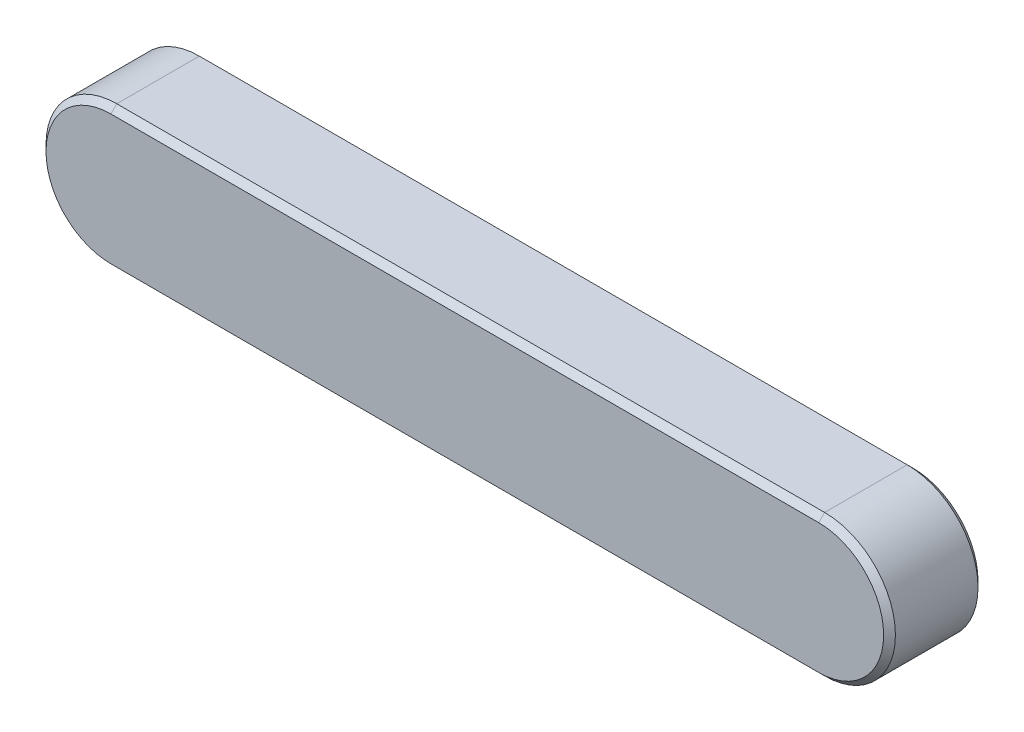
ISO-10303-21;
HEADER;
FILE_DESCRIPTION(('STEP AP214'),'2;1');
FILE_NAME('part.step','',(''),(''),'','','');
FILE_SCHEMA(('AUTOMOTIVE_DESIGN { 1 0 10303 214 1 1 1 1 }'));
ENDSEC;
DATA;
#1=APPLICATION_CONTEXT('core data for automotive mechanical design processes');
#2=APPLICATION_PROTOCOL_DEFINITION('international standard','automotive_design',2000,#1);
#3=PRODUCT_CONTEXT('',#1,'mechanical');
#4=PRODUCT('Part','Part','',(#3));
#5=PRODUCT_RELATED_PRODUCT_CATEGORY('part','',(#4));
#6=PRODUCT_DEFINITION_FORMATION('','',#4);
#7=PRODUCT_DEFINITION_CONTEXT('part definition',#1,'design');
#8=PRODUCT_DEFINITION('design','',#6,#7);
#9=PRODUCT_DEFINITION_SHAPE('','',#8);
#10=(LENGTH_UNIT() NAMED_UNIT(*) SI_UNIT(.MILLI.,.METRE.));
#11=(NAMED_UNIT(*) PLANE_ANGLE_UNIT() SI_UNIT($,.RADIAN.));
#12=(NAMED_UNIT(*) SI_UNIT($,.STERADIAN.) SOLID_ANGLE_UNIT());
#13=UNCERTAINTY_MEASURE_WITH_UNIT(LENGTH_MEASURE(1.E-05),#10,'distance_accuracy_value','');
#14=(GEOMETRIC_REPRESENTATION_CONTEXT(3) GLOBAL_UNCERTAINTY_ASSIGNED_CONTEXT((#13)) GLOBAL_UNIT_ASSIGNED_CONTEXT((#10,
#11,#12)) REPRESENTATION_CONTEXT('',''));
#15=CARTESIAN_POINT('',(0.,0.,0.));
#16=DIRECTION('',(0.,0.,1.));
#17=DIRECTION('',(1.,0.,0.));
#18=AXIS2_PLACEMENT_3D('',#15,#16,#17);
#19=CARTESIAN_POINT('',(0.,0.,4.));
#20=DIRECTION('',(0.,0.,-1.));
#21=DIRECTION('',(-1.,0.,0.));
#22=AXIS2_PLACEMENT_3D('',#19,#20,#21);
#23=CYLINDRICAL_SURFACE('',#22,3.);
#24=DIRECTION('',(0.,0.,-1.));
#25=VECTOR('',#24,1.);
#26=CARTESIAN_POINT('',(0.,-3.,4.));
#27=LINE('',#26,#25);
#28=CARTESIAN_POINT('',(0.,-3.,3.75));
#29=VERTEX_POINT('',#28);
#30=CARTESIAN_POINT('',(0.,-3.,0.249999999999997));
#31=VERTEX_POINT('',#30);
#32=EDGE_CURVE('E152',#29,#31,#27,.T.);
#33=ORIENTED_EDGE('',*,*,#32,.T.);
#34=CARTESIAN_POINT('',(0.,0.,0.249999999999997));
#35=DIRECTION('',(0.,0.,1.));
#36=DIRECTION('',(1.,0.,0.));
#37=AXIS2_PLACEMENT_3D('',#34,#35,#36);
#38=CIRCLE('',#37,3.);
#39=CARTESIAN_POINT('',(0.,3.,0.249999999999997));
#40=VERTEX_POINT('',#39);
#41=EDGE_CURVE('E176',#31,#40,#38,.T.);
#42=ORIENTED_EDGE('',*,*,#41,.T.);
#43=DIRECTION('',(0.,0.,-1.));
#44=VECTOR('',#43,1.);
#45=CARTESIAN_POINT('',(0.,3.,4.));
#46=LINE('',#45,#44);
#47=CARTESIAN_POINT('',(0.,3.,3.75));
#48=VERTEX_POINT('',#47);
#49=EDGE_CURVE('E121',#48,#40,#46,.T.);
#50=ORIENTED_EDGE('',*,*,#49,.F.);
#51=CARTESIAN_POINT('',(0.,0.,3.75));
#52=DIRECTION('',(0.,0.,1.));
#53=DIRECTION('',(1.,0.,0.));
#54=AXIS2_PLACEMENT_3D('',#51,#52,#53);
#55=CIRCLE('',#54,3.);
#56=EDGE_CURVE('E174',#48,#29,#55,.F.);
#57=ORIENTED_EDGE('',*,*,#56,.T.);
#58=EDGE_LOOP('',(#33,#42,#50,#57));
#59=FACE_BOUND('',#58,.T.);
#60=ADVANCED_FACE('F30',(#59),#23,.T.);
#61=CARTESIAN_POINT('',(0.,3.,4.));
#62=DIRECTION('',(0.,-1.,0.));
#63=DIRECTION('',(1.,0.,0.));
#64=AXIS2_PLACEMENT_3D('',#61,#62,#63);
#65=PLANE('',#64);
#66=ORIENTED_EDGE('',*,*,#49,.T.);
#67=DIRECTION('',(-1.,0.,0.));
#68=VECTOR('',#67,1.);
#69=CARTESIAN_POINT('',(0.,3.,0.249999999999993));
#70=LINE('',#69,#68);
#71=CARTESIAN_POINT('',(-30.,3.,0.249999999999997));
#72=VERTEX_POINT('',#71);
#73=EDGE_CURVE('E120',#40,#72,#70,.T.);
#74=ORIENTED_EDGE('',*,*,#73,.T.);
#75=DIRECTION('',(0.,0.,-1.));
#76=VECTOR('',#75,1.);
#77=CARTESIAN_POINT('',(-30.,3.,4.));
#78=LINE('',#77,#76);
#79=CARTESIAN_POINT('',(-30.,3.,3.75));
#80=VERTEX_POINT('',#79);
#81=EDGE_CURVE('E103',#80,#72,#78,.T.);
#82=ORIENTED_EDGE('',*,*,#81,.F.);
#83=DIRECTION('',(1.,0.,0.));
#84=VECTOR('',#83,1.);
#85=CARTESIAN_POINT('',(0.,3.,3.75));
#86=LINE('',#85,#84);
#87=EDGE_CURVE('E117',#80,#48,#86,.T.);
#88=ORIENTED_EDGE('',*,*,#87,.T.);
#89=EDGE_LOOP('',(#66,#74,#82,#88));
#90=FACE_BOUND('',#89,.T.);
#91=ADVANCED_FACE('F116',(#90),#65,.F.);
#92=CARTESIAN_POINT('',(-30.,0.,4.));
#93=DIRECTION('',(0.,0.,-1.));
#94=DIRECTION('',(-1.,0.,0.));
#95=AXIS2_PLACEMENT_3D('',#92,#93,#94);
#96=CYLINDRICAL_SURFACE('',#95,3.);
#97=ORIENTED_EDGE('',*,*,#81,.T.);
#98=CARTESIAN_POINT('',(-30.,0.,0.249999999999997));
#99=DIRECTION('',(0.,0.,1.));
#100=DIRECTION('',(1.,0.,0.));
#101=AXIS2_PLACEMENT_3D('',#98,#99,#100);
#102=CIRCLE('',#101,3.);
#103=CARTESIAN_POINT('',(-30.,-3.,0.249999999999997));
#104=VERTEX_POINT('',#103);
#105=EDGE_CURVE('E109',#72,#104,#102,.T.);
#106=ORIENTED_EDGE('',*,*,#105,.T.);
#107=DIRECTION('',(0.,0.,-1.));
#108=VECTOR('',#107,1.);
#109=CARTESIAN_POINT('',(-30.,-3.,4.));
#110=LINE('',#109,#108);
#111=CARTESIAN_POINT('',(-30.,-3.,3.75));
#112=VERTEX_POINT('',#111);
#113=EDGE_CURVE('E105',#112,#104,#110,.T.);
#114=ORIENTED_EDGE('',*,*,#113,.F.);
#115=CARTESIAN_POINT('',(-30.,0.,3.75));
#116=DIRECTION('',(0.,0.,1.));
#117=DIRECTION('',(1.,0.,0.));
#118=AXIS2_PLACEMENT_3D('',#115,#116,#117);
#119=CIRCLE('',#118,3.);
#120=EDGE_CURVE('E100',#112,#80,#119,.F.);
#121=ORIENTED_EDGE('',*,*,#120,.T.);
#122=EDGE_LOOP('',(#97,#106,#114,#121));
#123=FACE_BOUND('',#122,.T.);
#124=ADVANCED_FACE('F102',(#123),#96,.T.);
#125=CARTESIAN_POINT('',(-30.,-3.,4.));
#126=DIRECTION('',(0.,1.,0.));
#127=DIRECTION('',(0.,0.,1.));
#128=AXIS2_PLACEMENT_3D('',#125,#126,#127);
#129=PLANE('',#128);
#130=ORIENTED_EDGE('',*,*,#113,.T.);
#131=DIRECTION('',(1.,0.,0.));
#132=VECTOR('',#131,1.);
#133=CARTESIAN_POINT('',(-30.,-3.,0.249999999999997));
#134=LINE('',#133,#132);
#135=EDGE_CURVE('E180',#104,#31,#134,.T.);
#136=ORIENTED_EDGE('',*,*,#135,.T.);
#137=ORIENTED_EDGE('',*,*,#32,.F.);
#138=DIRECTION('',(-1.,0.,0.));
#139=VECTOR('',#138,1.);
#140=CARTESIAN_POINT('',(-30.,-3.,3.75));
#141=LINE('',#140,#139);
#142=EDGE_CURVE('E178',#29,#112,#141,.T.);
#143=ORIENTED_EDGE('',*,*,#142,.T.);
#144=EDGE_LOOP('',(#130,#136,#137,#143));
#145=FACE_BOUND('',#144,.T.);
#146=ADVANCED_FACE('F190',(#145),#129,.F.);
#147=CARTESIAN_POINT('',(0.,0.,4.));
#148=DIRECTION('',(0.,0.,1.));
#149=DIRECTION('',(1.,0.,0.));
#150=AXIS2_PLACEMENT_3D('',#147,#148,#149);
#151=PLANE('',#150);
#152=CARTESIAN_POINT('',(0.,0.,4.));
#153=DIRECTION('',(0.,0.,1.));
#154=DIRECTION('',(1.,0.,0.));
#155=AXIS2_PLACEMENT_3D('',#152,#153,#154);
#156=CIRCLE('',#155,2.75);
#157=CARTESIAN_POINT('',(0.,-2.75,4.));
#158=VERTEX_POINT('',#157);
#159=CARTESIAN_POINT('',(0.,2.75,4.));
#160=VERTEX_POINT('',#159);
#161=EDGE_CURVE('E54',#158,#160,#156,.T.);
#162=ORIENTED_EDGE('',*,*,#161,.T.);
#163=DIRECTION('',(-1.,0.,0.));
#164=VECTOR('',#163,1.);
#165=CARTESIAN_POINT('',(-30.,2.75,4.));
#166=LINE('',#165,#164);
#167=CARTESIAN_POINT('',(-30.,2.75,4.));
#168=VERTEX_POINT('',#167);
#169=EDGE_CURVE('E11',#160,#168,#166,.T.);
#170=ORIENTED_EDGE('',*,*,#169,.T.);
#171=CARTESIAN_POINT('',(-30.,0.,4.));
#172=DIRECTION('',(0.,0.,1.));
#173=DIRECTION('',(1.,0.,0.));
#174=AXIS2_PLACEMENT_3D('',#171,#172,#173);
#175=CIRCLE('',#174,2.75);
#176=CARTESIAN_POINT('',(-30.,-2.75,4.));
#177=VERTEX_POINT('',#176);
#178=EDGE_CURVE('E39',#168,#177,#175,.T.);
#179=ORIENTED_EDGE('',*,*,#178,.T.);
#180=DIRECTION('',(1.,0.,0.));
#181=VECTOR('',#180,1.);
#182=CARTESIAN_POINT('',(0.,-2.75,4.));
#183=LINE('',#182,#181);
#184=EDGE_CURVE('E182',#177,#158,#183,.T.);
#185=ORIENTED_EDGE('',*,*,#184,.T.);
#186=EDGE_LOOP('',(#162,#170,#179,#185));
#187=FACE_BOUND('',#186,.T.);
#188=ADVANCED_FACE('F185',(#187),#151,.T.);
#189=CARTESIAN_POINT('',(0.,0.,0.));
#190=DIRECTION('',(0.,0.,1.));
#191=DIRECTION('',(1.,0.,0.));
#192=AXIS2_PLACEMENT_3D('',#189,#190,#191);
#193=PLANE('',#192);
#194=CARTESIAN_POINT('',(-30.,0.,0.));
#195=DIRECTION('',(0.,0.,1.));
#196=DIRECTION('',(1.,0.,0.));
#197=AXIS2_PLACEMENT_3D('',#194,#195,#196);
#198=CIRCLE('',#197,2.75);
#199=CARTESIAN_POINT('',(-30.,-2.75,0.));
#200=VERTEX_POINT('',#199);
#201=CARTESIAN_POINT('',(-30.,2.75,0.));
#202=VERTEX_POINT('',#201);
#203=EDGE_CURVE('E169',#200,#202,#198,.F.);
#204=ORIENTED_EDGE('',*,*,#203,.T.);
#205=DIRECTION('',(1.,0.,0.));
#206=VECTOR('',#205,1.);
#207=CARTESIAN_POINT('',(0.,2.75,0.));
#208=LINE('',#207,#206);
#209=CARTESIAN_POINT('',(0.,2.75,0.));
#210=VERTEX_POINT('',#209);
#211=EDGE_CURVE('E110',#202,#210,#208,.T.);
#212=ORIENTED_EDGE('',*,*,#211,.T.);
#213=CARTESIAN_POINT('',(0.,0.,0.));
#214=DIRECTION('',(0.,0.,1.));
#215=DIRECTION('',(1.,0.,0.));
#216=AXIS2_PLACEMENT_3D('',#213,#214,#215);
#217=CIRCLE('',#216,2.75);
#218=CARTESIAN_POINT('',(0.,-2.75,0.));
#219=VERTEX_POINT('',#218);
#220=EDGE_CURVE('E167',#210,#219,#217,.F.);
#221=ORIENTED_EDGE('',*,*,#220,.T.);
#222=DIRECTION('',(-1.,0.,0.));
#223=VECTOR('',#222,1.);
#224=CARTESIAN_POINT('',(0.,-2.75,0.));
#225=LINE('',#224,#223);
#226=EDGE_CURVE('E165',#219,#200,#225,.T.);
#227=ORIENTED_EDGE('',*,*,#226,.T.);
#228=EDGE_LOOP('',(#204,#212,#221,#227));
#229=FACE_BOUND('',#228,.T.);
#230=ADVANCED_FACE('F217',(#229),#193,.F.);
#231=CARTESIAN_POINT('',(-30.,-3.,0.249999999999997));
#232=DIRECTION('',(0.,0.707106781186543,0.707106781186552));
#233=DIRECTION('',(0.,-0.707106781186552,0.707106781186543));
#234=AXIS2_PLACEMENT_3D('',#231,#232,#233);
#235=PLANE('',#234);
#236=DIRECTION('',(0.,-0.707106781186552,0.707106781186543));
#237=VECTOR('',#236,1.);
#238=CARTESIAN_POINT('',(-30.,-2.75,0.));
#239=LINE('',#238,#237);
#240=EDGE_CURVE('E144',#200,#104,#239,.T.);
#241=ORIENTED_EDGE('',*,*,#240,.F.);
#242=ORIENTED_EDGE('',*,*,#226,.F.);
#243=DIRECTION('',(0.,0.707106781186552,-0.707106781186543));
#244=VECTOR('',#243,1.);
#245=CARTESIAN_POINT('',(0.,-3.,0.249999999999997));
#246=LINE('',#245,#244);
#247=EDGE_CURVE('E132',#31,#219,#246,.T.);
#248=ORIENTED_EDGE('',*,*,#247,.F.);
#249=ORIENTED_EDGE('',*,*,#135,.F.);
#250=EDGE_LOOP('',(#241,#242,#248,#249));
#251=FACE_BOUND('',#250,.T.);
#252=ADVANCED_FACE('F193',(#251),#235,.F.);
#253=CARTESIAN_POINT('',(0.,0.,0.249999999999997));
#254=DIRECTION('',(0.,0.,1.));
#255=DIRECTION('',(1.,0.,0.));
#256=AXIS2_PLACEMENT_3D('',#253,#254,#255);
#257=CONICAL_SURFACE('',#256,3.,0.785398163397455);
#258=ORIENTED_EDGE('',*,*,#247,.T.);
#259=ORIENTED_EDGE('',*,*,#220,.F.);
#260=DIRECTION('',(0.,-0.707106781186552,-0.707106781186543));
#261=VECTOR('',#260,1.);
#262=CARTESIAN_POINT('',(0.,3.,0.249999999999997));
#263=LINE('',#262,#261);
#264=EDGE_CURVE('E138',#40,#210,#263,.T.);
#265=ORIENTED_EDGE('',*,*,#264,.F.);
#266=ORIENTED_EDGE('',*,*,#41,.F.);
#267=EDGE_LOOP('',(#258,#259,#265,#266));
#268=FACE_BOUND('',#267,.T.);
#269=ADVANCED_FACE('F196',(#268),#257,.T.);
#270=CARTESIAN_POINT('',(-30.,0.,0.249999999999997));
#271=DIRECTION('',(0.,0.,1.));
#272=DIRECTION('',(1.,0.,0.));
#273=AXIS2_PLACEMENT_3D('',#270,#271,#272);
#274=CONICAL_SURFACE('',#273,3.,0.785398163397455);
#275=ORIENTED_EDGE('',*,*,#240,.T.);
#276=ORIENTED_EDGE('',*,*,#105,.F.);
#277=DIRECTION('',(0.,0.707106781186552,0.707106781186543));
#278=VECTOR('',#277,1.);
#279=CARTESIAN_POINT('',(-30.,2.75,0.));
#280=LINE('',#279,#278);
#281=EDGE_CURVE('E135',#202,#72,#280,.T.);
#282=ORIENTED_EDGE('',*,*,#281,.F.);
#283=ORIENTED_EDGE('',*,*,#203,.F.);
#284=EDGE_LOOP('',(#275,#276,#282,#283));
#285=FACE_BOUND('',#284,.T.);
#286=ADVANCED_FACE('F199',(#285),#274,.T.);
#287=CARTESIAN_POINT('',(0.,3.,0.249999999999993));
#288=DIRECTION('',(0.,-0.707106781186543,0.707106781186552));
#289=DIRECTION('',(0.,-0.707106781186552,-0.707106781186543));
#290=AXIS2_PLACEMENT_3D('',#287,#288,#289);
#291=PLANE('',#290);
#292=ORIENTED_EDGE('',*,*,#264,.T.);
#293=ORIENTED_EDGE('',*,*,#211,.F.);
#294=ORIENTED_EDGE('',*,*,#281,.T.);
#295=ORIENTED_EDGE('',*,*,#73,.F.);
#296=EDGE_LOOP('',(#292,#293,#294,#295));
#297=FACE_BOUND('',#296,.T.);
#298=ADVANCED_FACE('F197',(#297),#291,.F.);
#299=CARTESIAN_POINT('',(0.,-2.75,4.));
#300=DIRECTION('',(0.,-0.707106781186552,0.707106781186543));
#301=DIRECTION('',(0.,-0.707106781186543,-0.707106781186552));
#302=AXIS2_PLACEMENT_3D('',#299,#300,#301);
#303=PLANE('',#302);
#304=DIRECTION('',(0.,0.707106781186543,0.707106781186552));
#305=VECTOR('',#304,1.);
#306=CARTESIAN_POINT('',(-30.,-3.,3.75));
#307=LINE('',#306,#305);
#308=EDGE_CURVE('E129',#112,#177,#307,.T.);
#309=ORIENTED_EDGE('',*,*,#308,.F.);
#310=ORIENTED_EDGE('',*,*,#142,.F.);
#311=DIRECTION('',(0.,-0.707106781186543,-0.707106781186552));
#312=VECTOR('',#311,1.);
#313=CARTESIAN_POINT('',(0.,-2.75,4.));
#314=LINE('',#313,#312);
#315=EDGE_CURVE('E34',#158,#29,#314,.T.);
#316=ORIENTED_EDGE('',*,*,#315,.F.);
#317=ORIENTED_EDGE('',*,*,#184,.F.);
#318=EDGE_LOOP('',(#309,#310,#316,#317));
#319=FACE_BOUND('',#318,.T.);
#320=ADVANCED_FACE('F32',(#319),#303,.T.);
#321=CARTESIAN_POINT('',(0.,0.,4.));
#322=DIRECTION('',(0.,0.,-1.));
#323=DIRECTION('',(-1.,0.,0.));
#324=AXIS2_PLACEMENT_3D('',#321,#322,#323);
#325=CONICAL_SURFACE('',#324,2.75,0.785398163397441);
#326=ORIENTED_EDGE('',*,*,#315,.T.);
#327=ORIENTED_EDGE('',*,*,#56,.F.);
#328=DIRECTION('',(0.,0.707106781186543,-0.707106781186552));
#329=VECTOR('',#328,1.);
#330=CARTESIAN_POINT('',(0.,2.75,4.));
#331=LINE('',#330,#329);
#332=EDGE_CURVE('E124',#160,#48,#331,.T.);
#333=ORIENTED_EDGE('',*,*,#332,.F.);
#334=ORIENTED_EDGE('',*,*,#161,.F.);
#335=EDGE_LOOP('',(#326,#327,#333,#334));
#336=FACE_BOUND('',#335,.T.);
#337=ADVANCED_FACE('F188',(#336),#325,.T.);
#338=CARTESIAN_POINT('',(-30.,0.,4.));
#339=DIRECTION('',(0.,0.,-1.));
#340=DIRECTION('',(-1.,0.,0.));
#341=AXIS2_PLACEMENT_3D('',#338,#339,#340);
#342=CONICAL_SURFACE('',#341,2.75,0.785398163397441);
#343=ORIENTED_EDGE('',*,*,#308,.T.);
#344=ORIENTED_EDGE('',*,*,#178,.F.);
#345=DIRECTION('',(0.,-0.707106781186543,0.707106781186552));
#346=VECTOR('',#345,1.);
#347=CARTESIAN_POINT('',(-30.,3.,3.75));
#348=LINE('',#347,#346);
#349=EDGE_CURVE('E47',#80,#168,#348,.T.);
#350=ORIENTED_EDGE('',*,*,#349,.F.);
#351=ORIENTED_EDGE('',*,*,#120,.F.);
#352=EDGE_LOOP('',(#343,#344,#350,#351));
#353=FACE_BOUND('',#352,.T.);
#354=ADVANCED_FACE('F127',(#353),#342,.T.);
#355=CARTESIAN_POINT('',(0.,2.75,4.));
#356=DIRECTION('',(0.,0.707106781186552,0.707106781186543));
#357=DIRECTION('',(0.,-0.707106781186543,0.707106781186552));
#358=AXIS2_PLACEMENT_3D('',#355,#356,#357);
#359=PLANE('',#358);
#360=ORIENTED_EDGE('',*,*,#332,.T.);
#361=ORIENTED_EDGE('',*,*,#87,.F.);
#362=ORIENTED_EDGE('',*,*,#349,.T.);
#363=ORIENTED_EDGE('',*,*,#169,.F.);
#364=EDGE_LOOP('',(#360,#361,#362,#363));
#365=FACE_BOUND('',#364,.T.);
#366=ADVANCED_FACE('F123',(#365),#359,.T.);
#367=CLOSED_SHELL('',(#60,#91,#124,#146,#188,#230,#252,#269,#286,#298,#320,#337,#354,#366));
#368=MANIFOLD_SOLID_BREP('B2',#367);
#369=ADVANCED_BREP_SHAPE_REPRESENTATION('',(#18,#368),#14);
#370=SHAPE_DEFINITION_REPRESENTATION(#9,#369);
ENDSEC;
END-ISO-10303-21;
